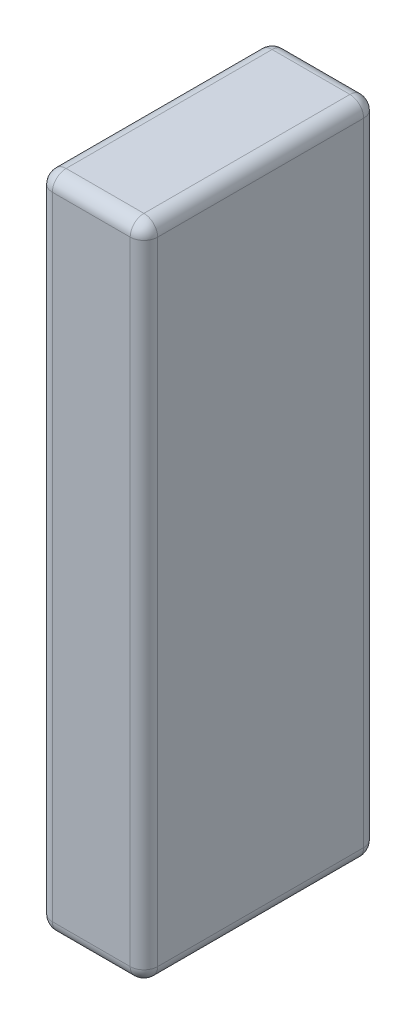
ISO-10303-21;
HEADER;
FILE_DESCRIPTION(('STEP AP214'),'2;1');
FILE_NAME('part.step','',(''),(''),'','','');
FILE_SCHEMA(('AUTOMOTIVE_DESIGN { 1 0 10303 214 1 1 1 1 }'));
ENDSEC;
DATA;
#1=APPLICATION_CONTEXT('core data for automotive mechanical design processes');
#2=APPLICATION_PROTOCOL_DEFINITION('international standard','automotive_design',2000,#1);
#3=PRODUCT_CONTEXT('',#1,'mechanical');
#4=PRODUCT('Part','Part','',(#3));
#5=PRODUCT_RELATED_PRODUCT_CATEGORY('part','',(#4));
#6=PRODUCT_DEFINITION_FORMATION('','',#4);
#7=PRODUCT_DEFINITION_CONTEXT('part definition',#1,'design');
#8=PRODUCT_DEFINITION('design','',#6,#7);
#9=PRODUCT_DEFINITION_SHAPE('','',#8);
#10=(LENGTH_UNIT() NAMED_UNIT(*) SI_UNIT(.MILLI.,.METRE.));
#11=(NAMED_UNIT(*) PLANE_ANGLE_UNIT() SI_UNIT($,.RADIAN.));
#12=(NAMED_UNIT(*) SI_UNIT($,.STERADIAN.) SOLID_ANGLE_UNIT());
#13=UNCERTAINTY_MEASURE_WITH_UNIT(LENGTH_MEASURE(1.E-05),#10,'distance_accuracy_value','');
#14=(GEOMETRIC_REPRESENTATION_CONTEXT(3) GLOBAL_UNCERTAINTY_ASSIGNED_CONTEXT((#13)) GLOBAL_UNIT_ASSIGNED_CONTEXT((#10,
#11,#12)) REPRESENTATION_CONTEXT('',''));
#15=CARTESIAN_POINT('',(0.,0.,0.));
#16=DIRECTION('',(0.,0.,1.));
#17=DIRECTION('',(1.,0.,0.));
#18=AXIS2_PLACEMENT_3D('',#15,#16,#17);
#19=CARTESIAN_POINT('',(0.,144.,0.));
#20=DIRECTION('',(1.,0.,0.));
#21=DIRECTION('',(0.,0.,-1.));
#22=AXIS2_PLACEMENT_3D('',#19,#20,#21);
#23=PLANE('',#22);
#24=DIRECTION('',(0.,0.,1.));
#25=VECTOR('',#24,1.);
#26=CARTESIAN_POINT('',(0.,141.,0.));
#27=LINE('',#26,#25);
#28=CARTESIAN_POINT('',(0.,141.,-3.));
#29=VERTEX_POINT('',#28);
#30=CARTESIAN_POINT('',(0.,141.,-48.));
#31=VERTEX_POINT('',#30);
#32=EDGE_CURVE('E153',#29,#31,#27,.F.);
#33=ORIENTED_EDGE('',*,*,#32,.T.);
#34=DIRECTION('',(0.,-1.,0.));
#35=VECTOR('',#34,1.);
#36=CARTESIAN_POINT('',(0.,144.,-48.));
#37=LINE('',#36,#35);
#38=CARTESIAN_POINT('',(0.,3.,-48.));
#39=VERTEX_POINT('',#38);
#40=EDGE_CURVE('E221',#31,#39,#37,.T.);
#41=ORIENTED_EDGE('',*,*,#40,.T.);
#42=DIRECTION('',(0.,0.,1.));
#43=VECTOR('',#42,1.);
#44=CARTESIAN_POINT('',(0.,3.,0.));
#45=LINE('',#44,#43);
#46=CARTESIAN_POINT('',(0.,3.,-3.));
#47=VERTEX_POINT('',#46);
#48=EDGE_CURVE('E280',#39,#47,#45,.T.);
#49=ORIENTED_EDGE('',*,*,#48,.T.);
#50=DIRECTION('',(0.,-1.,0.));
#51=VECTOR('',#50,1.);
#52=CARTESIAN_POINT('',(0.,144.,-3.));
#53=LINE('',#52,#51);
#54=EDGE_CURVE('E278',#47,#29,#53,.F.);
#55=ORIENTED_EDGE('',*,*,#54,.T.);
#56=EDGE_LOOP('',(#33,#41,#49,#55));
#57=FACE_BOUND('',#56,.T.);
#58=ADVANCED_FACE('F34',(#57),#23,.F.);
#59=CARTESIAN_POINT('',(0.,144.,0.));
#60=DIRECTION('',(0.,0.,-1.));
#61=DIRECTION('',(-1.,0.,0.));
#62=AXIS2_PLACEMENT_3D('',#59,#60,#61);
#63=PLANE('',#62);
#64=DIRECTION('',(1.,0.,0.));
#65=VECTOR('',#64,1.);
#66=CARTESIAN_POINT('',(0.,141.,0.));
#67=LINE('',#66,#65);
#68=CARTESIAN_POINT('',(20.,141.,0.));
#69=VERTEX_POINT('',#68);
#70=CARTESIAN_POINT('',(3.,141.,0.));
#71=VERTEX_POINT('',#70);
#72=EDGE_CURVE('E43',#69,#71,#67,.F.);
#73=ORIENTED_EDGE('',*,*,#72,.T.);
#74=DIRECTION('',(0.,-1.,0.));
#75=VECTOR('',#74,1.);
#76=CARTESIAN_POINT('',(3.,144.,0.));
#77=LINE('',#76,#75);
#78=CARTESIAN_POINT('',(3.,3.,0.));
#79=VERTEX_POINT('',#78);
#80=EDGE_CURVE('E11',#71,#79,#77,.T.);
#81=ORIENTED_EDGE('',*,*,#80,.T.);
#82=DIRECTION('',(1.,0.,0.));
#83=VECTOR('',#82,1.);
#84=CARTESIAN_POINT('',(23.,3.,0.));
#85=LINE('',#84,#83);
#86=CARTESIAN_POINT('',(20.,3.,0.));
#87=VERTEX_POINT('',#86);
#88=EDGE_CURVE('E227',#79,#87,#85,.T.);
#89=ORIENTED_EDGE('',*,*,#88,.T.);
#90=DIRECTION('',(0.,-1.,0.));
#91=VECTOR('',#90,1.);
#92=CARTESIAN_POINT('',(20.,144.,0.));
#93=LINE('',#92,#91);
#94=EDGE_CURVE('E54',#87,#69,#93,.F.);
#95=ORIENTED_EDGE('',*,*,#94,.T.);
#96=EDGE_LOOP('',(#73,#81,#89,#95));
#97=FACE_BOUND('',#96,.T.);
#98=ADVANCED_FACE('F318',(#97),#63,.F.);
#99=CARTESIAN_POINT('',(23.,144.,0.));
#100=DIRECTION('',(-1.,0.,0.));
#101=DIRECTION('',(0.,0.,1.));
#102=AXIS2_PLACEMENT_3D('',#99,#100,#101);
#103=PLANE('',#102);
#104=DIRECTION('',(0.,-1.,0.));
#105=VECTOR('',#104,1.);
#106=CARTESIAN_POINT('',(23.,144.,-48.));
#107=LINE('',#106,#105);
#108=CARTESIAN_POINT('',(23.,3.,-48.));
#109=VERTEX_POINT('',#108);
#110=CARTESIAN_POINT('',(23.,141.,-48.));
#111=VERTEX_POINT('',#110);
#112=EDGE_CURVE('E216',#109,#111,#107,.F.);
#113=ORIENTED_EDGE('',*,*,#112,.T.);
#114=DIRECTION('',(0.,0.,-1.));
#115=VECTOR('',#114,1.);
#116=CARTESIAN_POINT('',(23.,141.,0.));
#117=LINE('',#116,#115);
#118=CARTESIAN_POINT('',(23.,141.,-3.));
#119=VERTEX_POINT('',#118);
#120=EDGE_CURVE('E219',#111,#119,#117,.F.);
#121=ORIENTED_EDGE('',*,*,#120,.T.);
#122=DIRECTION('',(0.,-1.,0.));
#123=VECTOR('',#122,1.);
#124=CARTESIAN_POINT('',(23.,144.,-3.));
#125=LINE('',#124,#123);
#126=CARTESIAN_POINT('',(23.,3.,-3.));
#127=VERTEX_POINT('',#126);
#128=EDGE_CURVE('E217',#119,#127,#125,.T.);
#129=ORIENTED_EDGE('',*,*,#128,.T.);
#130=DIRECTION('',(0.,0.,-1.));
#131=VECTOR('',#130,1.);
#132=CARTESIAN_POINT('',(23.,3.,-51.));
#133=LINE('',#132,#131);
#134=EDGE_CURVE('E213',#127,#109,#133,.T.);
#135=ORIENTED_EDGE('',*,*,#134,.T.);
#136=EDGE_LOOP('',(#113,#121,#129,#135));
#137=FACE_BOUND('',#136,.T.);
#138=ADVANCED_FACE('F298',(#137),#103,.F.);
#139=CARTESIAN_POINT('',(0.,144.,-51.));
#140=DIRECTION('',(0.,0.,1.));
#141=DIRECTION('',(1.,0.,0.));
#142=AXIS2_PLACEMENT_3D('',#139,#140,#141);
#143=PLANE('',#142);
#144=DIRECTION('',(-1.,0.,0.));
#145=VECTOR('',#144,1.);
#146=CARTESIAN_POINT('',(0.,3.,-51.));
#147=LINE('',#146,#145);
#148=CARTESIAN_POINT('',(20.,3.,-51.));
#149=VERTEX_POINT('',#148);
#150=CARTESIAN_POINT('',(3.,3.,-51.));
#151=VERTEX_POINT('',#150);
#152=EDGE_CURVE('E257',#149,#151,#147,.T.);
#153=ORIENTED_EDGE('',*,*,#152,.T.);
#154=DIRECTION('',(0.,-1.,0.));
#155=VECTOR('',#154,1.);
#156=CARTESIAN_POINT('',(3.,144.,-51.));
#157=LINE('',#156,#155);
#158=CARTESIAN_POINT('',(3.,141.,-51.));
#159=VERTEX_POINT('',#158);
#160=EDGE_CURVE('E263',#151,#159,#157,.F.);
#161=ORIENTED_EDGE('',*,*,#160,.T.);
#162=DIRECTION('',(-1.,0.,0.));
#163=VECTOR('',#162,1.);
#164=CARTESIAN_POINT('',(0.,141.,-51.));
#165=LINE('',#164,#163);
#166=CARTESIAN_POINT('',(20.,141.,-51.));
#167=VERTEX_POINT('',#166);
#168=EDGE_CURVE('E260',#159,#167,#165,.F.);
#169=ORIENTED_EDGE('',*,*,#168,.T.);
#170=DIRECTION('',(0.,-1.,0.));
#171=VECTOR('',#170,1.);
#172=CARTESIAN_POINT('',(20.,144.,-51.));
#173=LINE('',#172,#171);
#174=EDGE_CURVE('E252',#167,#149,#173,.T.);
#175=ORIENTED_EDGE('',*,*,#174,.T.);
#176=EDGE_LOOP('',(#153,#161,#169,#175));
#177=FACE_BOUND('',#176,.T.);
#178=ADVANCED_FACE('F261',(#177),#143,.F.);
#179=CARTESIAN_POINT('',(0.,144.,0.));
#180=DIRECTION('',(0.,-1.,0.));
#181=DIRECTION('',(0.,0.,-1.));
#182=AXIS2_PLACEMENT_3D('',#179,#180,#181);
#183=PLANE('',#182);
#184=DIRECTION('',(0.,0.,-1.));
#185=VECTOR('',#184,1.);
#186=CARTESIAN_POINT('',(20.,144.,0.));
#187=LINE('',#186,#185);
#188=CARTESIAN_POINT('',(20.,144.,-3.));
#189=VERTEX_POINT('',#188);
#190=CARTESIAN_POINT('',(20.,144.,-48.));
#191=VERTEX_POINT('',#190);
#192=EDGE_CURVE('E132',#189,#191,#187,.T.);
#193=ORIENTED_EDGE('',*,*,#192,.T.);
#194=DIRECTION('',(-1.,0.,0.));
#195=VECTOR('',#194,1.);
#196=CARTESIAN_POINT('',(0.,144.,-48.));
#197=LINE('',#196,#195);
#198=CARTESIAN_POINT('',(3.,144.,-48.));
#199=VERTEX_POINT('',#198);
#200=EDGE_CURVE('E128',#191,#199,#197,.T.);
#201=ORIENTED_EDGE('',*,*,#200,.T.);
#202=DIRECTION('',(0.,0.,1.));
#203=VECTOR('',#202,1.);
#204=CARTESIAN_POINT('',(3.,144.,0.));
#205=LINE('',#204,#203);
#206=CARTESIAN_POINT('',(3.,144.,-3.));
#207=VERTEX_POINT('',#206);
#208=EDGE_CURVE('E122',#199,#207,#205,.T.);
#209=ORIENTED_EDGE('',*,*,#208,.T.);
#210=DIRECTION('',(1.,0.,0.));
#211=VECTOR('',#210,1.);
#212=CARTESIAN_POINT('',(0.,144.,-3.));
#213=LINE('',#212,#211);
#214=EDGE_CURVE('E125',#207,#189,#213,.T.);
#215=ORIENTED_EDGE('',*,*,#214,.T.);
#216=EDGE_LOOP('',(#193,#201,#209,#215));
#217=FACE_BOUND('',#216,.T.);
#218=ADVANCED_FACE('F124',(#217),#183,.F.);
#219=CARTESIAN_POINT('',(0.,0.,0.));
#220=DIRECTION('',(0.,-1.,0.));
#221=DIRECTION('',(0.,0.,-1.));
#222=AXIS2_PLACEMENT_3D('',#219,#220,#221);
#223=PLANE('',#222);
#224=DIRECTION('',(0.,0.,1.));
#225=VECTOR('',#224,1.);
#226=CARTESIAN_POINT('',(3.,0.,-51.));
#227=LINE('',#226,#225);
#228=CARTESIAN_POINT('',(3.,0.,-3.));
#229=VERTEX_POINT('',#228);
#230=CARTESIAN_POINT('',(3.,0.,-48.));
#231=VERTEX_POINT('',#230);
#232=EDGE_CURVE('E274',#229,#231,#227,.F.);
#233=ORIENTED_EDGE('',*,*,#232,.T.);
#234=DIRECTION('',(-1.,0.,0.));
#235=VECTOR('',#234,1.);
#236=CARTESIAN_POINT('',(23.,0.,-48.));
#237=LINE('',#236,#235);
#238=CARTESIAN_POINT('',(20.,0.,-48.));
#239=VERTEX_POINT('',#238);
#240=EDGE_CURVE('E276',#231,#239,#237,.F.);
#241=ORIENTED_EDGE('',*,*,#240,.T.);
#242=DIRECTION('',(0.,0.,-1.));
#243=VECTOR('',#242,1.);
#244=CARTESIAN_POINT('',(20.,0.,0.));
#245=LINE('',#244,#243);
#246=CARTESIAN_POINT('',(20.,0.,-3.));
#247=VERTEX_POINT('',#246);
#248=EDGE_CURVE('E211',#239,#247,#245,.F.);
#249=ORIENTED_EDGE('',*,*,#248,.T.);
#250=DIRECTION('',(1.,0.,0.));
#251=VECTOR('',#250,1.);
#252=CARTESIAN_POINT('',(0.,0.,-3.));
#253=LINE('',#252,#251);
#254=EDGE_CURVE('E268',#247,#229,#253,.F.);
#255=ORIENTED_EDGE('',*,*,#254,.T.);
#256=EDGE_LOOP('',(#233,#241,#249,#255));
#257=FACE_BOUND('',#256,.T.);
#258=ADVANCED_FACE('F357',(#257),#223,.T.);
#259=CARTESIAN_POINT('',(0.,3.,-3.));
#260=DIRECTION('',(-1.,0.,0.));
#261=DIRECTION('',(0.,0.,1.));
#262=AXIS2_PLACEMENT_3D('',#259,#260,#261);
#263=CYLINDRICAL_SURFACE('',#262,3.);
#264=CARTESIAN_POINT('',(20.,3.,-3.));
#265=DIRECTION('',(1.,0.,0.));
#266=DIRECTION('',(0.,0.,-1.));
#267=AXIS2_PLACEMENT_3D('',#264,#265,#266);
#268=CIRCLE('',#267,3.);
#269=EDGE_CURVE('E38',#87,#247,#268,.T.);
#270=ORIENTED_EDGE('',*,*,#269,.F.);
#271=ORIENTED_EDGE('',*,*,#88,.F.);
#272=CARTESIAN_POINT('',(3.,3.,-3.));
#273=DIRECTION('',(-1.,0.,0.));
#274=DIRECTION('',(0.,0.,1.));
#275=AXIS2_PLACEMENT_3D('',#272,#273,#274);
#276=CIRCLE('',#275,3.);
#277=EDGE_CURVE('E191',#229,#79,#276,.T.);
#278=ORIENTED_EDGE('',*,*,#277,.F.);
#279=ORIENTED_EDGE('',*,*,#254,.F.);
#280=EDGE_LOOP('',(#270,#271,#278,#279));
#281=FACE_BOUND('',#280,.T.);
#282=ADVANCED_FACE('F36',(#281),#263,.T.);
#283=CARTESIAN_POINT('',(20.,3.,-3.));
#284=DIRECTION('',(0.,0.,1.));
#285=DIRECTION('',(1.,0.,0.));
#286=AXIS2_PLACEMENT_3D('',#283,#284,#285);
#287=SPHERICAL_SURFACE('',#286,3.);
#288=CARTESIAN_POINT('',(20.,3.,-3.));
#289=DIRECTION('',(0.,-1.,0.));
#290=DIRECTION('',(0.,0.,-1.));
#291=AXIS2_PLACEMENT_3D('',#288,#289,#290);
#292=CIRCLE('',#291,3.);
#293=EDGE_CURVE('E186',#87,#127,#292,.F.);
#294=ORIENTED_EDGE('',*,*,#293,.F.);
#295=ORIENTED_EDGE('',*,*,#269,.T.);
#296=CARTESIAN_POINT('',(20.,3.,-3.));
#297=DIRECTION('',(0.,0.,1.));
#298=DIRECTION('',(1.,0.,0.));
#299=AXIS2_PLACEMENT_3D('',#296,#297,#298);
#300=CIRCLE('',#299,3.);
#301=EDGE_CURVE('E189',#127,#247,#300,.F.);
#302=ORIENTED_EDGE('',*,*,#301,.F.);
#303=EDGE_LOOP('',(#294,#295,#302));
#304=FACE_BOUND('',#303,.T.);
#305=ADVANCED_FACE('F203',(#304),#287,.T.);
#306=CARTESIAN_POINT('',(3.,3.,-3.));
#307=DIRECTION('',(0.,0.,1.));
#308=DIRECTION('',(1.,0.,0.));
#309=AXIS2_PLACEMENT_3D('',#306,#307,#308);
#310=SPHERICAL_SURFACE('',#309,3.);
#311=CARTESIAN_POINT('',(3.,3.,-3.));
#312=DIRECTION('',(0.,0.,1.));
#313=DIRECTION('',(1.,0.,0.));
#314=AXIS2_PLACEMENT_3D('',#311,#312,#313);
#315=CIRCLE('',#314,3.);
#316=EDGE_CURVE('E181',#229,#47,#315,.F.);
#317=ORIENTED_EDGE('',*,*,#316,.F.);
#318=ORIENTED_EDGE('',*,*,#277,.T.);
#319=CARTESIAN_POINT('',(3.,3.,-3.));
#320=DIRECTION('',(0.,-1.,0.));
#321=DIRECTION('',(0.,0.,-1.));
#322=AXIS2_PLACEMENT_3D('',#319,#320,#321);
#323=CIRCLE('',#322,3.);
#324=EDGE_CURVE('E184',#47,#79,#323,.F.);
#325=ORIENTED_EDGE('',*,*,#324,.F.);
#326=EDGE_LOOP('',(#317,#318,#325));
#327=FACE_BOUND('',#326,.T.);
#328=ADVANCED_FACE('F354',(#327),#310,.T.);
#329=CARTESIAN_POINT('',(20.,3.,0.));
#330=DIRECTION('',(0.,0.,1.));
#331=DIRECTION('',(1.,0.,0.));
#332=AXIS2_PLACEMENT_3D('',#329,#330,#331);
#333=CYLINDRICAL_SURFACE('',#332,3.);
#334=ORIENTED_EDGE('',*,*,#301,.T.);
#335=ORIENTED_EDGE('',*,*,#248,.F.);
#336=CARTESIAN_POINT('',(20.,3.,-48.));
#337=DIRECTION('',(0.,0.,-1.));
#338=DIRECTION('',(-1.,0.,0.));
#339=AXIS2_PLACEMENT_3D('',#336,#337,#338);
#340=CIRCLE('',#339,3.);
#341=EDGE_CURVE('E176',#109,#239,#340,.T.);
#342=ORIENTED_EDGE('',*,*,#341,.F.);
#343=ORIENTED_EDGE('',*,*,#134,.F.);
#344=EDGE_LOOP('',(#334,#335,#342,#343));
#345=FACE_BOUND('',#344,.T.);
#346=ADVANCED_FACE('F209',(#345),#333,.T.);
#347=CARTESIAN_POINT('',(20.,144.,-3.));
#348=DIRECTION('',(0.,-1.,0.));
#349=DIRECTION('',(0.,0.,-1.));
#350=AXIS2_PLACEMENT_3D('',#347,#348,#349);
#351=CYLINDRICAL_SURFACE('',#350,3.);
#352=ORIENTED_EDGE('',*,*,#293,.T.);
#353=ORIENTED_EDGE('',*,*,#128,.F.);
#354=CARTESIAN_POINT('',(20.,141.,-3.));
#355=DIRECTION('',(0.,1.,0.));
#356=DIRECTION('',(0.,0.,1.));
#357=AXIS2_PLACEMENT_3D('',#354,#355,#356);
#358=CIRCLE('',#357,3.);
#359=EDGE_CURVE('E173',#69,#119,#358,.T.);
#360=ORIENTED_EDGE('',*,*,#359,.F.);
#361=ORIENTED_EDGE('',*,*,#94,.F.);
#362=EDGE_LOOP('',(#352,#353,#360,#361));
#363=FACE_BOUND('',#362,.T.);
#364=ADVANCED_FACE('F302',(#363),#351,.T.);
#365=CARTESIAN_POINT('',(0.,141.,-3.));
#366=DIRECTION('',(1.,0.,0.));
#367=DIRECTION('',(0.,0.,-1.));
#368=AXIS2_PLACEMENT_3D('',#365,#366,#367);
#369=CYLINDRICAL_SURFACE('',#368,3.);
#370=CARTESIAN_POINT('',(3.,141.,-3.));
#371=DIRECTION('',(-1.,0.,0.));
#372=DIRECTION('',(0.,0.,1.));
#373=AXIS2_PLACEMENT_3D('',#370,#371,#372);
#374=CIRCLE('',#373,3.);
#375=EDGE_CURVE('E138',#71,#207,#374,.T.);
#376=ORIENTED_EDGE('',*,*,#375,.F.);
#377=ORIENTED_EDGE('',*,*,#72,.F.);
#378=CARTESIAN_POINT('',(20.,141.,-3.));
#379=DIRECTION('',(1.,0.,0.));
#380=DIRECTION('',(0.,0.,-1.));
#381=AXIS2_PLACEMENT_3D('',#378,#379,#380);
#382=CIRCLE('',#381,3.);
#383=EDGE_CURVE('E141',#189,#69,#382,.T.);
#384=ORIENTED_EDGE('',*,*,#383,.F.);
#385=ORIENTED_EDGE('',*,*,#214,.F.);
#386=EDGE_LOOP('',(#376,#377,#384,#385));
#387=FACE_BOUND('',#386,.T.);
#388=ADVANCED_FACE('F137',(#387),#369,.T.);
#389=CARTESIAN_POINT('',(3.,144.,-3.));
#390=DIRECTION('',(0.,-1.,0.));
#391=DIRECTION('',(0.,0.,-1.));
#392=AXIS2_PLACEMENT_3D('',#389,#390,#391);
#393=CYLINDRICAL_SURFACE('',#392,3.);
#394=ORIENTED_EDGE('',*,*,#324,.T.);
#395=ORIENTED_EDGE('',*,*,#80,.F.);
#396=CARTESIAN_POINT('',(3.,141.,-3.));
#397=DIRECTION('',(0.,1.,0.));
#398=DIRECTION('',(0.,0.,1.));
#399=AXIS2_PLACEMENT_3D('',#396,#397,#398);
#400=CIRCLE('',#399,3.);
#401=EDGE_CURVE('E150',#29,#71,#400,.T.);
#402=ORIENTED_EDGE('',*,*,#401,.F.);
#403=ORIENTED_EDGE('',*,*,#54,.F.);
#404=EDGE_LOOP('',(#394,#395,#402,#403));
#405=FACE_BOUND('',#404,.T.);
#406=ADVANCED_FACE('F356',(#405),#393,.T.);
#407=CARTESIAN_POINT('',(3.,3.,0.));
#408=DIRECTION('',(0.,0.,-1.));
#409=DIRECTION('',(-1.,0.,0.));
#410=AXIS2_PLACEMENT_3D('',#407,#408,#409);
#411=CYLINDRICAL_SURFACE('',#410,3.);
#412=ORIENTED_EDGE('',*,*,#316,.T.);
#413=ORIENTED_EDGE('',*,*,#48,.F.);
#414=CARTESIAN_POINT('',(3.,3.,-48.));
#415=DIRECTION('',(0.,0.,-1.));
#416=DIRECTION('',(-1.,0.,0.));
#417=AXIS2_PLACEMENT_3D('',#414,#415,#416);
#418=CIRCLE('',#417,3.);
#419=EDGE_CURVE('E168',#231,#39,#418,.T.);
#420=ORIENTED_EDGE('',*,*,#419,.F.);
#421=ORIENTED_EDGE('',*,*,#232,.F.);
#422=EDGE_LOOP('',(#412,#413,#420,#421));
#423=FACE_BOUND('',#422,.T.);
#424=ADVANCED_FACE('F352',(#423),#411,.T.);
#425=CARTESIAN_POINT('',(0.,3.,-48.));
#426=DIRECTION('',(1.,0.,0.));
#427=DIRECTION('',(0.,0.,-1.));
#428=AXIS2_PLACEMENT_3D('',#425,#426,#427);
#429=CYLINDRICAL_SURFACE('',#428,3.);
#430=CARTESIAN_POINT('',(20.,3.,-48.));
#431=DIRECTION('',(1.,0.,0.));
#432=DIRECTION('',(0.,0.,-1.));
#433=AXIS2_PLACEMENT_3D('',#430,#431,#432);
#434=CIRCLE('',#433,3.);
#435=EDGE_CURVE('E178',#239,#149,#434,.T.);
#436=ORIENTED_EDGE('',*,*,#435,.F.);
#437=ORIENTED_EDGE('',*,*,#240,.F.);
#438=CARTESIAN_POINT('',(3.,3.,-48.));
#439=DIRECTION('',(-1.,0.,0.));
#440=DIRECTION('',(0.,0.,1.));
#441=AXIS2_PLACEMENT_3D('',#438,#439,#440);
#442=CIRCLE('',#441,3.);
#443=EDGE_CURVE('E165',#151,#231,#442,.T.);
#444=ORIENTED_EDGE('',*,*,#443,.F.);
#445=ORIENTED_EDGE('',*,*,#152,.F.);
#446=EDGE_LOOP('',(#436,#437,#444,#445));
#447=FACE_BOUND('',#446,.T.);
#448=ADVANCED_FACE('F314',(#447),#429,.T.);
#449=CARTESIAN_POINT('',(20.,3.,-48.));
#450=DIRECTION('',(0.,0.,1.));
#451=DIRECTION('',(1.,0.,0.));
#452=AXIS2_PLACEMENT_3D('',#449,#450,#451);
#453=SPHERICAL_SURFACE('',#452,3.);
#454=ORIENTED_EDGE('',*,*,#341,.T.);
#455=ORIENTED_EDGE('',*,*,#435,.T.);
#456=CARTESIAN_POINT('',(20.,3.,-48.));
#457=DIRECTION('',(0.,-1.,0.));
#458=DIRECTION('',(0.,0.,-1.));
#459=AXIS2_PLACEMENT_3D('',#456,#457,#458);
#460=CIRCLE('',#459,3.);
#461=EDGE_CURVE('E157',#109,#149,#460,.F.);
#462=ORIENTED_EDGE('',*,*,#461,.F.);
#463=EDGE_LOOP('',(#454,#455,#462));
#464=FACE_BOUND('',#463,.T.);
#465=ADVANCED_FACE('F306',(#464),#453,.T.);
#466=CARTESIAN_POINT('',(20.,141.,-3.));
#467=DIRECTION('',(0.,0.,1.));
#468=DIRECTION('',(1.,0.,0.));
#469=AXIS2_PLACEMENT_3D('',#466,#467,#468);
#470=SPHERICAL_SURFACE('',#469,3.);
#471=ORIENTED_EDGE('',*,*,#383,.T.);
#472=ORIENTED_EDGE('',*,*,#359,.T.);
#473=CARTESIAN_POINT('',(20.,141.,-3.));
#474=DIRECTION('',(0.,0.,1.));
#475=DIRECTION('',(1.,0.,0.));
#476=AXIS2_PLACEMENT_3D('',#473,#474,#475);
#477=CIRCLE('',#476,3.);
#478=EDGE_CURVE('E154',#189,#119,#477,.F.);
#479=ORIENTED_EDGE('',*,*,#478,.F.);
#480=EDGE_LOOP('',(#471,#472,#479));
#481=FACE_BOUND('',#480,.T.);
#482=ADVANCED_FACE('F304',(#481),#470,.T.);
#483=CARTESIAN_POINT('',(3.,141.,-3.));
#484=DIRECTION('',(0.,0.,1.));
#485=DIRECTION('',(1.,0.,0.));
#486=AXIS2_PLACEMENT_3D('',#483,#484,#485);
#487=SPHERICAL_SURFACE('',#486,3.);
#488=ORIENTED_EDGE('',*,*,#401,.T.);
#489=ORIENTED_EDGE('',*,*,#375,.T.);
#490=CARTESIAN_POINT('',(3.,141.,-3.));
#491=DIRECTION('',(0.,0.,1.));
#492=DIRECTION('',(1.,0.,0.));
#493=AXIS2_PLACEMENT_3D('',#490,#491,#492);
#494=CIRCLE('',#493,3.);
#495=EDGE_CURVE('E147',#29,#207,#494,.F.);
#496=ORIENTED_EDGE('',*,*,#495,.F.);
#497=EDGE_LOOP('',(#488,#489,#496));
#498=FACE_BOUND('',#497,.T.);
#499=ADVANCED_FACE('F146',(#498),#487,.T.);
#500=CARTESIAN_POINT('',(3.,3.,-48.));
#501=DIRECTION('',(0.,0.,1.));
#502=DIRECTION('',(1.,0.,0.));
#503=AXIS2_PLACEMENT_3D('',#500,#501,#502);
#504=SPHERICAL_SURFACE('',#503,3.);
#505=ORIENTED_EDGE('',*,*,#443,.T.);
#506=ORIENTED_EDGE('',*,*,#419,.T.);
#507=CARTESIAN_POINT('',(3.,3.,-48.));
#508=DIRECTION('',(0.,-1.,0.));
#509=DIRECTION('',(0.,0.,-1.));
#510=AXIS2_PLACEMENT_3D('',#507,#508,#509);
#511=CIRCLE('',#510,3.);
#512=EDGE_CURVE('E155',#151,#39,#511,.F.);
#513=ORIENTED_EDGE('',*,*,#512,.F.);
#514=EDGE_LOOP('',(#505,#506,#513));
#515=FACE_BOUND('',#514,.T.);
#516=ADVANCED_FACE('F312',(#515),#504,.T.);
#517=CARTESIAN_POINT('',(20.,144.,-48.));
#518=DIRECTION('',(0.,-1.,0.));
#519=DIRECTION('',(0.,0.,-1.));
#520=AXIS2_PLACEMENT_3D('',#517,#518,#519);
#521=CYLINDRICAL_SURFACE('',#520,3.);
#522=ORIENTED_EDGE('',*,*,#461,.T.);
#523=ORIENTED_EDGE('',*,*,#174,.F.);
#524=CARTESIAN_POINT('',(20.,141.,-48.));
#525=DIRECTION('',(0.,1.,0.));
#526=DIRECTION('',(0.,0.,1.));
#527=AXIS2_PLACEMENT_3D('',#524,#525,#526);
#528=CIRCLE('',#527,3.);
#529=EDGE_CURVE('E159',#111,#167,#528,.T.);
#530=ORIENTED_EDGE('',*,*,#529,.F.);
#531=ORIENTED_EDGE('',*,*,#112,.F.);
#532=EDGE_LOOP('',(#522,#523,#530,#531));
#533=FACE_BOUND('',#532,.T.);
#534=ADVANCED_FACE('F254',(#533),#521,.T.);
#535=CARTESIAN_POINT('',(20.,141.,0.));
#536=DIRECTION('',(0.,0.,-1.));
#537=DIRECTION('',(-1.,0.,0.));
#538=AXIS2_PLACEMENT_3D('',#535,#536,#537);
#539=CYLINDRICAL_SURFACE('',#538,3.);
#540=ORIENTED_EDGE('',*,*,#478,.T.);
#541=ORIENTED_EDGE('',*,*,#120,.F.);
#542=CARTESIAN_POINT('',(20.,141.,-48.));
#543=DIRECTION('',(0.,0.,-1.));
#544=DIRECTION('',(-1.,0.,0.));
#545=AXIS2_PLACEMENT_3D('',#542,#543,#544);
#546=CIRCLE('',#545,3.);
#547=EDGE_CURVE('E241',#191,#111,#546,.T.);
#548=ORIENTED_EDGE('',*,*,#547,.F.);
#549=ORIENTED_EDGE('',*,*,#192,.F.);
#550=EDGE_LOOP('',(#540,#541,#548,#549));
#551=FACE_BOUND('',#550,.T.);
#552=ADVANCED_FACE('F297',(#551),#539,.T.);
#553=CARTESIAN_POINT('',(3.,141.,0.));
#554=DIRECTION('',(0.,0.,1.));
#555=DIRECTION('',(1.,0.,0.));
#556=AXIS2_PLACEMENT_3D('',#553,#554,#555);
#557=CYLINDRICAL_SURFACE('',#556,3.);
#558=ORIENTED_EDGE('',*,*,#495,.T.);
#559=ORIENTED_EDGE('',*,*,#208,.F.);
#560=CARTESIAN_POINT('',(3.,141.,-48.));
#561=DIRECTION('',(0.,0.,-1.));
#562=DIRECTION('',(-1.,0.,0.));
#563=AXIS2_PLACEMENT_3D('',#560,#561,#562);
#564=CIRCLE('',#563,3.);
#565=EDGE_CURVE('E238',#31,#199,#564,.T.);
#566=ORIENTED_EDGE('',*,*,#565,.F.);
#567=ORIENTED_EDGE('',*,*,#32,.F.);
#568=EDGE_LOOP('',(#558,#559,#566,#567));
#569=FACE_BOUND('',#568,.T.);
#570=ADVANCED_FACE('F152',(#569),#557,.T.);
#571=CARTESIAN_POINT('',(3.,144.,-48.));
#572=DIRECTION('',(0.,-1.,0.));
#573=DIRECTION('',(0.,0.,-1.));
#574=AXIS2_PLACEMENT_3D('',#571,#572,#573);
#575=CYLINDRICAL_SURFACE('',#574,3.);
#576=ORIENTED_EDGE('',*,*,#512,.T.);
#577=ORIENTED_EDGE('',*,*,#40,.F.);
#578=CARTESIAN_POINT('',(3.,141.,-48.));
#579=DIRECTION('',(0.,1.,0.));
#580=DIRECTION('',(0.,0.,1.));
#581=AXIS2_PLACEMENT_3D('',#578,#579,#580);
#582=CIRCLE('',#581,3.);
#583=EDGE_CURVE('E235',#159,#31,#582,.T.);
#584=ORIENTED_EDGE('',*,*,#583,.F.);
#585=ORIENTED_EDGE('',*,*,#160,.F.);
#586=EDGE_LOOP('',(#576,#577,#584,#585));
#587=FACE_BOUND('',#586,.T.);
#588=ADVANCED_FACE('F287',(#587),#575,.T.);
#589=CARTESIAN_POINT('',(20.,141.,-48.));
#590=DIRECTION('',(0.,0.,1.));
#591=DIRECTION('',(1.,0.,0.));
#592=AXIS2_PLACEMENT_3D('',#589,#590,#591);
#593=SPHERICAL_SURFACE('',#592,3.);
#594=ORIENTED_EDGE('',*,*,#547,.T.);
#595=ORIENTED_EDGE('',*,*,#529,.T.);
#596=CARTESIAN_POINT('',(20.,141.,-48.));
#597=DIRECTION('',(1.,0.,0.));
#598=DIRECTION('',(0.,0.,-1.));
#599=AXIS2_PLACEMENT_3D('',#596,#597,#598);
#600=CIRCLE('',#599,3.);
#601=EDGE_CURVE('E233',#191,#167,#600,.F.);
#602=ORIENTED_EDGE('',*,*,#601,.F.);
#603=EDGE_LOOP('',(#594,#595,#602));
#604=FACE_BOUND('',#603,.T.);
#605=ADVANCED_FACE('F248',(#604),#593,.T.);
#606=CARTESIAN_POINT('',(3.,141.,-48.));
#607=DIRECTION('',(0.,0.,1.));
#608=DIRECTION('',(1.,0.,0.));
#609=AXIS2_PLACEMENT_3D('',#606,#607,#608);
#610=SPHERICAL_SURFACE('',#609,3.);
#611=ORIENTED_EDGE('',*,*,#583,.T.);
#612=ORIENTED_EDGE('',*,*,#565,.T.);
#613=CARTESIAN_POINT('',(3.,141.,-48.));
#614=DIRECTION('',(-1.,0.,0.));
#615=DIRECTION('',(0.,0.,1.));
#616=AXIS2_PLACEMENT_3D('',#613,#614,#615);
#617=CIRCLE('',#616,3.);
#618=EDGE_CURVE('E231',#159,#199,#617,.F.);
#619=ORIENTED_EDGE('',*,*,#618,.F.);
#620=EDGE_LOOP('',(#611,#612,#619));
#621=FACE_BOUND('',#620,.T.);
#622=ADVANCED_FACE('F290',(#621),#610,.T.);
#623=CARTESIAN_POINT('',(0.,141.,-48.));
#624=DIRECTION('',(-1.,0.,0.));
#625=DIRECTION('',(0.,0.,1.));
#626=AXIS2_PLACEMENT_3D('',#623,#624,#625);
#627=CYLINDRICAL_SURFACE('',#626,3.);
#628=ORIENTED_EDGE('',*,*,#601,.T.);
#629=ORIENTED_EDGE('',*,*,#168,.F.);
#630=ORIENTED_EDGE('',*,*,#618,.T.);
#631=ORIENTED_EDGE('',*,*,#200,.F.);
#632=EDGE_LOOP('',(#628,#629,#630,#631));
#633=FACE_BOUND('',#632,.T.);
#634=ADVANCED_FACE('F291',(#633),#627,.T.);
#635=CLOSED_SHELL('',(#58,#98,#138,#178,#218,#258,#282,#305,#328,#346,#364,#388,#406,#424,#448,
#465,#482,#499,#516,#534,#552,#570,#588,#605,#622,#634));
#636=MANIFOLD_SOLID_BREP('B2',#635);
#637=ADVANCED_BREP_SHAPE_REPRESENTATION('',(#18,#636),#14);
#638=SHAPE_DEFINITION_REPRESENTATION(#9,#637);
ENDSEC;
END-ISO-10303-21;
